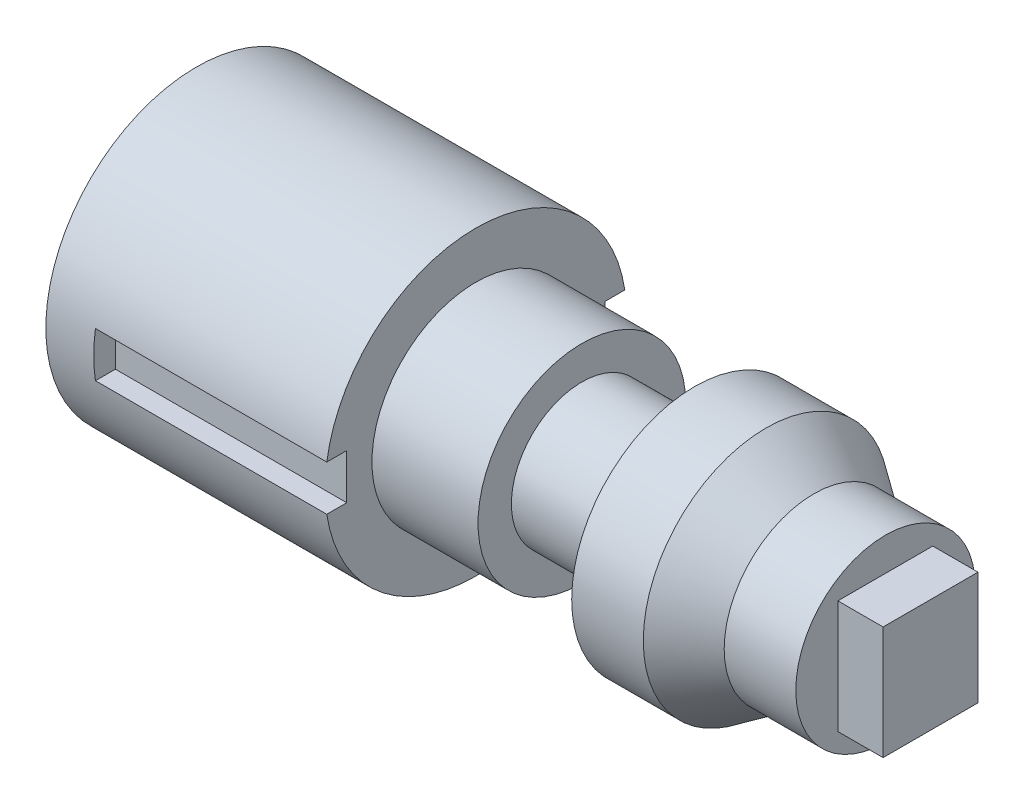
ISO-10303-21;
HEADER;
FILE_DESCRIPTION(('STEP AP214'),'2;1');
FILE_NAME('part.step','',(''),(''),'','','');
FILE_SCHEMA(('AUTOMOTIVE_DESIGN { 1 0 10303 214 1 1 1 1 }'));
ENDSEC;
DATA;
#1=APPLICATION_CONTEXT('core data for automotive mechanical design processes');
#2=APPLICATION_PROTOCOL_DEFINITION('international standard','automotive_design',2000,#1);
#3=PRODUCT_CONTEXT('',#1,'mechanical');
#4=PRODUCT('Part','Part','',(#3));
#5=PRODUCT_RELATED_PRODUCT_CATEGORY('part','',(#4));
#6=PRODUCT_DEFINITION_FORMATION('','',#4);
#7=PRODUCT_DEFINITION_CONTEXT('part definition',#1,'design');
#8=PRODUCT_DEFINITION('design','',#6,#7);
#9=PRODUCT_DEFINITION_SHAPE('','',#8);
#10=(LENGTH_UNIT() NAMED_UNIT(*) SI_UNIT(.MILLI.,.METRE.));
#11=(NAMED_UNIT(*) PLANE_ANGLE_UNIT() SI_UNIT($,.RADIAN.));
#12=(NAMED_UNIT(*) SI_UNIT($,.STERADIAN.) SOLID_ANGLE_UNIT());
#13=UNCERTAINTY_MEASURE_WITH_UNIT(LENGTH_MEASURE(1.E-05),#10,'distance_accuracy_value','');
#14=(GEOMETRIC_REPRESENTATION_CONTEXT(3) GLOBAL_UNCERTAINTY_ASSIGNED_CONTEXT((#13)) GLOBAL_UNIT_ASSIGNED_CONTEXT((#10,
#11,#12)) REPRESENTATION_CONTEXT('',''));
#15=CARTESIAN_POINT('',(0.,0.,0.));
#16=DIRECTION('',(0.,0.,1.));
#17=DIRECTION('',(1.,0.,0.));
#18=AXIS2_PLACEMENT_3D('',#15,#16,#17);
#19=CARTESIAN_POINT('',(45.7085192508289,0.,0.));
#20=DIRECTION('',(1.,0.,0.));
#21=DIRECTION('',(0.,0.,-1.));
#22=AXIS2_PLACEMENT_3D('',#19,#20,#21);
#23=CYLINDRICAL_SURFACE('',#22,10.);
#24=CARTESIAN_POINT('',(0.,0.,0.));
#25=DIRECTION('',(1.,0.,0.));
#26=DIRECTION('',(0.,0.,-1.));
#27=AXIS2_PLACEMENT_3D('',#24,#25,#26);
#28=CIRCLE('',#27,10.);
#29=CARTESIAN_POINT('',(0.,0.,-10.));
#30=VERTEX_POINT('',#29);
#31=EDGE_CURVE('E247',#30,#30,#28,.T.);
#32=ORIENTED_EDGE('',*,*,#31,.T.);
#33=EDGE_LOOP('',(#32));
#34=FACE_BOUND('',#33,.T.);
#35=CARTESIAN_POINT('',(3.17889936513499,0.,0.));
#36=DIRECTION('',(-1.,0.,0.));
#37=DIRECTION('',(0.,0.,1.));
#38=AXIS2_PLACEMENT_3D('',#35,#36,#37);
#39=CIRCLE('',#38,10.);
#40=CARTESIAN_POINT('',(3.17889936513498,-1.5,-9.88685996664259));
#41=VERTEX_POINT('',#40);
#42=CARTESIAN_POINT('',(3.17889936513498,1.5,-9.88685996664259));
#43=VERTEX_POINT('',#42);
#44=EDGE_CURVE('E11',#41,#43,#39,.F.);
#45=ORIENTED_EDGE('',*,*,#44,.F.);
#46=DIRECTION('',(1.,0.,0.));
#47=VECTOR('',#46,1.);
#48=CARTESIAN_POINT('',(45.7085192508289,-1.5,-9.88685996664259));
#49=LINE('',#48,#47);
#50=CARTESIAN_POINT('',(18.5256627897861,-1.5,-9.88685996664259));
#51=VERTEX_POINT('',#50);
#52=EDGE_CURVE('E206',#41,#51,#49,.T.);
#53=ORIENTED_EDGE('',*,*,#52,.T.);
#54=CARTESIAN_POINT('',(18.5256627897861,0.,0.));
#55=DIRECTION('',(1.,0.,0.));
#56=DIRECTION('',(0.,0.,-1.));
#57=AXIS2_PLACEMENT_3D('',#54,#55,#56);
#58=CIRCLE('',#57,10.);
#59=CARTESIAN_POINT('',(18.5256627897861,-1.5,9.88685996664259));
#60=VERTEX_POINT('',#59);
#61=EDGE_CURVE('E242',#60,#51,#58,.T.);
#62=ORIENTED_EDGE('',*,*,#61,.F.);
#63=DIRECTION('',(1.,0.,0.));
#64=VECTOR('',#63,1.);
#65=CARTESIAN_POINT('',(45.7085192508289,-1.5,9.88685996664259));
#66=LINE('',#65,#64);
#67=CARTESIAN_POINT('',(3.17889936513498,-1.5,9.88685996664259));
#68=VERTEX_POINT('',#67);
#69=EDGE_CURVE('E200',#68,#60,#66,.T.);
#70=ORIENTED_EDGE('',*,*,#69,.F.);
#71=CARTESIAN_POINT('',(3.17889936513499,0.,0.));
#72=DIRECTION('',(1.,0.,0.));
#73=DIRECTION('',(0.,0.,-1.));
#74=AXIS2_PLACEMENT_3D('',#71,#72,#73);
#75=CIRCLE('',#74,10.);
#76=CARTESIAN_POINT('',(3.17889936513498,1.5,9.88685996664259));
#77=VERTEX_POINT('',#76);
#78=EDGE_CURVE('E52',#68,#77,#75,.F.);
#79=ORIENTED_EDGE('',*,*,#78,.T.);
#80=DIRECTION('',(1.,0.,0.));
#81=VECTOR('',#80,1.);
#82=CARTESIAN_POINT('',(45.7085192508289,1.5,9.88685996664259));
#83=LINE('',#82,#81);
#84=CARTESIAN_POINT('',(18.5256627897861,1.5,9.88685996664259));
#85=VERTEX_POINT('',#84);
#86=EDGE_CURVE('E184',#77,#85,#83,.T.);
#87=ORIENTED_EDGE('',*,*,#86,.T.);
#88=CARTESIAN_POINT('',(18.5256627897861,1.5,-9.88685996664259));
#89=VERTEX_POINT('',#88);
#90=EDGE_CURVE('E243',#89,#85,#58,.T.);
#91=ORIENTED_EDGE('',*,*,#90,.F.);
#92=DIRECTION('',(1.,0.,0.));
#93=VECTOR('',#92,1.);
#94=CARTESIAN_POINT('',(45.7085192508289,1.5,-9.88685996664259));
#95=LINE('',#94,#93);
#96=EDGE_CURVE('E203',#43,#89,#95,.T.);
#97=ORIENTED_EDGE('',*,*,#96,.F.);
#98=EDGE_LOOP('',(#45,#53,#62,#70,#79,#87,#91,#97));
#99=FACE_BOUND('',#98,.T.);
#100=ADVANCED_FACE('F43',(#34,#99),#23,.T.);
#101=CARTESIAN_POINT('',(18.5256627897861,0.,-10.));
#102=DIRECTION('',(1.,0.,0.));
#103=DIRECTION('',(0.,0.,-1.));
#104=AXIS2_PLACEMENT_3D('',#101,#102,#103);
#105=PLANE('',#104);
#106=CARTESIAN_POINT('',(18.5256627897861,0.,0.));
#107=DIRECTION('',(1.,0.,0.));
#108=DIRECTION('',(0.,0.,-1.));
#109=AXIS2_PLACEMENT_3D('',#106,#107,#108);
#110=CIRCLE('',#109,6.89024048727054);
#111=CARTESIAN_POINT('',(18.5256627897861,0.,-6.89024048727054));
#112=VERTEX_POINT('',#111);
#113=EDGE_CURVE('E238',#112,#112,#110,.T.);
#114=ORIENTED_EDGE('',*,*,#113,.F.);
#115=EDGE_LOOP('',(#114));
#116=FACE_BOUND('',#115,.T.);
#117=ORIENTED_EDGE('',*,*,#61,.T.);
#118=DIRECTION('',(0.,0.,1.));
#119=VECTOR('',#118,1.);
#120=CARTESIAN_POINT('',(18.5256627897861,-1.5,-10.));
#121=LINE('',#120,#119);
#122=CARTESIAN_POINT('',(18.5256627897861,-1.5,-8.56238743965711));
#123=VERTEX_POINT('',#122);
#124=EDGE_CURVE('E268',#51,#123,#121,.T.);
#125=ORIENTED_EDGE('',*,*,#124,.T.);
#126=DIRECTION('',(0.,-1.,0.));
#127=VECTOR('',#126,1.);
#128=CARTESIAN_POINT('',(18.5256627897861,0.,-8.56238743965711));
#129=LINE('',#128,#127);
#130=CARTESIAN_POINT('',(18.5256627897861,1.5,-8.56238743965711));
#131=VERTEX_POINT('',#130);
#132=EDGE_CURVE('E265',#131,#123,#129,.T.);
#133=ORIENTED_EDGE('',*,*,#132,.F.);
#134=DIRECTION('',(0.,0.,1.));
#135=VECTOR('',#134,1.);
#136=CARTESIAN_POINT('',(18.5256627897861,1.5,-10.));
#137=LINE('',#136,#135);
#138=EDGE_CURVE('E262',#89,#131,#137,.T.);
#139=ORIENTED_EDGE('',*,*,#138,.F.);
#140=ORIENTED_EDGE('',*,*,#90,.T.);
#141=DIRECTION('',(0.,0.,-1.));
#142=VECTOR('',#141,1.);
#143=CARTESIAN_POINT('',(18.5256627897861,1.5,-10.));
#144=LINE('',#143,#142);
#145=CARTESIAN_POINT('',(18.5256627897861,1.5,8.56238743965711));
#146=VERTEX_POINT('',#145);
#147=EDGE_CURVE('E251',#85,#146,#144,.T.);
#148=ORIENTED_EDGE('',*,*,#147,.T.);
#149=DIRECTION('',(0.,-1.,0.));
#150=VECTOR('',#149,1.);
#151=CARTESIAN_POINT('',(18.5256627897861,0.,8.56238743965711));
#152=LINE('',#151,#150);
#153=CARTESIAN_POINT('',(18.5256627897861,-1.5,8.56238743965711));
#154=VERTEX_POINT('',#153);
#155=EDGE_CURVE('E255',#146,#154,#152,.T.);
#156=ORIENTED_EDGE('',*,*,#155,.T.);
#157=DIRECTION('',(0.,0.,-1.));
#158=VECTOR('',#157,1.);
#159=CARTESIAN_POINT('',(18.5256627897861,-1.5,-10.));
#160=LINE('',#159,#158);
#161=EDGE_CURVE('E259',#60,#154,#160,.T.);
#162=ORIENTED_EDGE('',*,*,#161,.F.);
#163=EDGE_LOOP('',(#117,#125,#133,#139,#140,#148,#156,#162));
#164=FACE_BOUND('',#163,.T.);
#165=ADVANCED_FACE('F295',(#116,#164),#105,.T.);
#166=CARTESIAN_POINT('',(0.,0.,0.));
#167=DIRECTION('',(-1.,0.,0.));
#168=DIRECTION('',(0.,0.,1.));
#169=AXIS2_PLACEMENT_3D('',#166,#167,#168);
#170=PLANE('',#169);
#171=ORIENTED_EDGE('',*,*,#31,.F.);
#172=EDGE_LOOP('',(#171));
#173=FACE_BOUND('',#172,.T.);
#174=ADVANCED_FACE('F45',(#173),#170,.T.);
#175=CARTESIAN_POINT('',(45.7085192508289,0.,0.));
#176=DIRECTION('',(1.,0.,0.));
#177=DIRECTION('',(0.,0.,-1.));
#178=AXIS2_PLACEMENT_3D('',#175,#176,#177);
#179=CYLINDRICAL_SURFACE('',#178,6.89024048727054);
#180=ORIENTED_EDGE('',*,*,#113,.T.);
#181=EDGE_LOOP('',(#180));
#182=FACE_BOUND('',#181,.T.);
#183=CARTESIAN_POINT('',(25.5632955305092,0.,0.));
#184=DIRECTION('',(1.,0.,0.));
#185=DIRECTION('',(0.,0.,-1.));
#186=AXIS2_PLACEMENT_3D('',#183,#184,#185);
#187=CIRCLE('',#186,6.89024048727054);
#188=CARTESIAN_POINT('',(25.5632955305092,0.,-6.89024048727054));
#189=VERTEX_POINT('',#188);
#190=EDGE_CURVE('E234',#189,#189,#187,.T.);
#191=ORIENTED_EDGE('',*,*,#190,.F.);
#192=EDGE_LOOP('',(#191));
#193=FACE_BOUND('',#192,.T.);
#194=ADVANCED_FACE('F331',(#182,#193),#179,.T.);
#195=CARTESIAN_POINT('',(25.5632955305092,0.,-6.89024048727054));
#196=DIRECTION('',(1.,0.,0.));
#197=DIRECTION('',(0.,0.,-1.));
#198=AXIS2_PLACEMENT_3D('',#195,#196,#197);
#199=PLANE('',#198);
#200=ORIENTED_EDGE('',*,*,#190,.T.);
#201=EDGE_LOOP('',(#200));
#202=FACE_BOUND('',#201,.T.);
#203=CARTESIAN_POINT('',(25.5632955305092,0.,0.));
#204=DIRECTION('',(1.,0.,0.));
#205=DIRECTION('',(0.,0.,-1.));
#206=AXIS2_PLACEMENT_3D('',#203,#204,#205);
#207=CIRCLE('',#206,4.67752868907863);
#208=CARTESIAN_POINT('',(25.5632955305092,0.,-4.67752868907863));
#209=VERTEX_POINT('',#208);
#210=EDGE_CURVE('E230',#209,#209,#207,.T.);
#211=ORIENTED_EDGE('',*,*,#210,.F.);
#212=EDGE_LOOP('',(#211));
#213=FACE_BOUND('',#212,.T.);
#214=ADVANCED_FACE('F334',(#202,#213),#199,.T.);
#215=CARTESIAN_POINT('',(45.7085192508289,0.,0.));
#216=DIRECTION('',(1.,0.,0.));
#217=DIRECTION('',(0.,0.,-1.));
#218=AXIS2_PLACEMENT_3D('',#215,#216,#217);
#219=CYLINDRICAL_SURFACE('',#218,4.67752868907863);
#220=ORIENTED_EDGE('',*,*,#210,.T.);
#221=EDGE_LOOP('',(#220));
#222=FACE_BOUND('',#221,.T.);
#223=CARTESIAN_POINT('',(33.0407803175274,0.,0.));
#224=DIRECTION('',(1.,0.,0.));
#225=DIRECTION('',(0.,0.,-1.));
#226=AXIS2_PLACEMENT_3D('',#223,#224,#225);
#227=CIRCLE('',#226,4.67752868907863);
#228=CARTESIAN_POINT('',(33.0407803175274,0.,-4.67752868907863));
#229=VERTEX_POINT('',#228);
#230=EDGE_CURVE('E226',#229,#229,#227,.T.);
#231=ORIENTED_EDGE('',*,*,#230,.F.);
#232=EDGE_LOOP('',(#231));
#233=FACE_BOUND('',#232,.T.);
#234=ADVANCED_FACE('F338',(#222,#233),#219,.T.);
#235=CARTESIAN_POINT('',(33.0407803175274,0.,-4.67752868907863));
#236=DIRECTION('',(-1.,0.,0.));
#237=DIRECTION('',(0.,0.,1.));
#238=AXIS2_PLACEMENT_3D('',#235,#236,#237);
#239=PLANE('',#238);
#240=ORIENTED_EDGE('',*,*,#230,.T.);
#241=EDGE_LOOP('',(#240));
#242=FACE_BOUND('',#241,.T.);
#243=CARTESIAN_POINT('',(33.0407803175274,0.,0.));
#244=DIRECTION('',(1.,0.,0.));
#245=DIRECTION('',(0.,0.,-1.));
#246=AXIS2_PLACEMENT_3D('',#243,#244,#245);
#247=CIRCLE('',#246,8.1526214055602);
#248=CARTESIAN_POINT('',(33.0407803175274,0.,-8.1526214055602));
#249=VERTEX_POINT('',#248);
#250=EDGE_CURVE('E222',#249,#249,#247,.T.);
#251=ORIENTED_EDGE('',*,*,#250,.F.);
#252=EDGE_LOOP('',(#251));
#253=FACE_BOUND('',#252,.T.);
#254=ADVANCED_FACE('F342',(#242,#253),#239,.T.);
#255=CARTESIAN_POINT('',(45.7085192508289,0.,0.));
#256=DIRECTION('',(1.,0.,0.));
#257=DIRECTION('',(0.,0.,-1.));
#258=AXIS2_PLACEMENT_3D('',#255,#256,#257);
#259=CYLINDRICAL_SURFACE('',#258,8.1526214055602);
#260=ORIENTED_EDGE('',*,*,#250,.T.);
#261=EDGE_LOOP('',(#260));
#262=FACE_BOUND('',#261,.T.);
#263=CARTESIAN_POINT('',(37.7911824175155,0.,0.));
#264=DIRECTION('',(1.,0.,0.));
#265=DIRECTION('',(0.,0.,-1.));
#266=AXIS2_PLACEMENT_3D('',#263,#264,#265);
#267=CIRCLE('',#266,8.1526214055602);
#268=CARTESIAN_POINT('',(37.7911824175155,0.,-8.1526214055602));
#269=VERTEX_POINT('',#268);
#270=EDGE_CURVE('E218',#269,#269,#267,.T.);
#271=ORIENTED_EDGE('',*,*,#270,.F.);
#272=EDGE_LOOP('',(#271));
#273=FACE_BOUND('',#272,.T.);
#274=ADVANCED_FACE('F346',(#262,#273),#259,.T.);
#275=CARTESIAN_POINT('',(40.9581171508409,0.,0.));
#276=DIRECTION('',(-1.,0.,0.));
#277=DIRECTION('',(0.,0.,1.));
#278=AXIS2_PLACEMENT_3D('',#275,#276,#277);
#279=CONICAL_SURFACE('',#278,5.95336117408424,0.606987664046407);
#280=ORIENTED_EDGE('',*,*,#270,.T.);
#281=EDGE_LOOP('',(#280));
#282=FACE_BOUND('',#281,.T.);
#283=CARTESIAN_POINT('',(40.9581171508409,0.,0.));
#284=DIRECTION('',(1.,0.,0.));
#285=DIRECTION('',(0.,0.,-1.));
#286=AXIS2_PLACEMENT_3D('',#283,#284,#285);
#287=CIRCLE('',#286,5.95336117408424);
#288=CARTESIAN_POINT('',(40.9581171508409,0.,-5.95336117408424));
#289=VERTEX_POINT('',#288);
#290=EDGE_CURVE('E214',#289,#289,#287,.T.);
#291=ORIENTED_EDGE('',*,*,#290,.F.);
#292=EDGE_LOOP('',(#291));
#293=FACE_BOUND('',#292,.T.);
#294=ADVANCED_FACE('F350',(#282,#293),#279,.T.);
#295=CARTESIAN_POINT('',(45.7085192508289,0.,0.));
#296=DIRECTION('',(1.,0.,0.));
#297=DIRECTION('',(0.,0.,-1.));
#298=AXIS2_PLACEMENT_3D('',#295,#296,#297);
#299=CYLINDRICAL_SURFACE('',#298,5.95336117408424);
#300=ORIENTED_EDGE('',*,*,#290,.T.);
#301=EDGE_LOOP('',(#300));
#302=FACE_BOUND('',#301,.T.);
#303=CARTESIAN_POINT('',(45.7085192508289,0.,0.));
#304=DIRECTION('',(1.,0.,0.));
#305=DIRECTION('',(0.,0.,-1.));
#306=AXIS2_PLACEMENT_3D('',#303,#304,#305);
#307=CIRCLE('',#306,5.95336117408424);
#308=CARTESIAN_POINT('',(45.7085192508289,0.,-5.95336117408424));
#309=VERTEX_POINT('',#308);
#310=EDGE_CURVE('E210',#309,#309,#307,.T.);
#311=ORIENTED_EDGE('',*,*,#310,.F.);
#312=EDGE_LOOP('',(#311));
#313=FACE_BOUND('',#312,.T.);
#314=ADVANCED_FACE('F354',(#302,#313),#299,.T.);
#315=CARTESIAN_POINT('',(45.7085192508289,0.,-5.95336117408424));
#316=DIRECTION('',(1.,0.,0.));
#317=DIRECTION('',(0.,0.,-1.));
#318=AXIS2_PLACEMENT_3D('',#315,#316,#317);
#319=PLANE('',#318);
#320=DIRECTION('',(0.,-1.,0.));
#321=VECTOR('',#320,1.);
#322=CARTESIAN_POINT('',(45.7085192508289,3.75333974069081,3.16058941680211));
#323=LINE('',#322,#321);
#324=CARTESIAN_POINT('',(45.7085192508289,3.75333974069081,3.16058941680211));
#325=VERTEX_POINT('',#324);
#326=CARTESIAN_POINT('',(45.7085192508289,-3.75574691954495,3.16058941680211));
#327=VERTEX_POINT('',#326);
#328=EDGE_CURVE('E59',#325,#327,#323,.T.);
#329=ORIENTED_EDGE('',*,*,#328,.F.);
#330=DIRECTION('',(0.,0.,1.));
#331=VECTOR('',#330,1.);
#332=CARTESIAN_POINT('',(45.7085192508289,3.75333974069081,3.16058941680211));
#333=LINE('',#332,#331);
#334=CARTESIAN_POINT('',(45.7085192508289,3.75333974069081,-3.13626800680367));
#335=VERTEX_POINT('',#334);
#336=EDGE_CURVE('E63',#335,#325,#333,.T.);
#337=ORIENTED_EDGE('',*,*,#336,.F.);
#338=DIRECTION('',(0.,1.,0.));
#339=VECTOR('',#338,1.);
#340=CARTESIAN_POINT('',(45.7085192508289,3.75333974069081,-3.13626800680367));
#341=LINE('',#340,#339);
#342=CARTESIAN_POINT('',(45.7085192508289,-3.75574691954495,-3.13626800680367));
#343=VERTEX_POINT('',#342);
#344=EDGE_CURVE('E578',#343,#335,#341,.T.);
#345=ORIENTED_EDGE('',*,*,#344,.F.);
#346=DIRECTION('',(0.,0.,-1.));
#347=VECTOR('',#346,1.);
#348=CARTESIAN_POINT('',(45.7085192508289,-3.75574691954495,3.16058941680211));
#349=LINE('',#348,#347);
#350=EDGE_CURVE('E588',#327,#343,#349,.T.);
#351=ORIENTED_EDGE('',*,*,#350,.F.);
#352=EDGE_LOOP('',(#329,#337,#345,#351));
#353=FACE_BOUND('',#352,.T.);
#354=ORIENTED_EDGE('',*,*,#310,.T.);
#355=EDGE_LOOP('',(#354));
#356=FACE_BOUND('',#355,.T.);
#357=ADVANCED_FACE('F358',(#353,#356),#319,.T.);
#358=CARTESIAN_POINT('',(3.17889936513498,-1.5,10.7378474406123));
#359=DIRECTION('',(1.,0.,0.));
#360=DIRECTION('',(0.,0.,-1.));
#361=AXIS2_PLACEMENT_3D('',#358,#359,#360);
#362=PLANE('',#361);
#363=DIRECTION('',(0.,0.,-1.));
#364=VECTOR('',#363,1.);
#365=CARTESIAN_POINT('',(3.17889936513498,-1.5,10.7378474406123));
#366=LINE('',#365,#364);
#367=CARTESIAN_POINT('',(3.17889936513498,-1.5,8.56238743965711));
#368=VERTEX_POINT('',#367);
#369=EDGE_CURVE('E189',#68,#368,#366,.T.);
#370=ORIENTED_EDGE('',*,*,#369,.T.);
#371=DIRECTION('',(0.,1.,0.));
#372=VECTOR('',#371,1.);
#373=CARTESIAN_POINT('',(3.17889936513498,-1.5,8.56238743965711));
#374=LINE('',#373,#372);
#375=CARTESIAN_POINT('',(3.17889936513498,1.5,8.56238743965711));
#376=VERTEX_POINT('',#375);
#377=EDGE_CURVE('E155',#368,#376,#374,.T.);
#378=ORIENTED_EDGE('',*,*,#377,.T.);
#379=DIRECTION('',(0.,0.,-1.));
#380=VECTOR('',#379,1.);
#381=CARTESIAN_POINT('',(3.17889936513498,1.5,10.7378474406123));
#382=LINE('',#381,#380);
#383=EDGE_CURVE('E178',#77,#376,#382,.T.);
#384=ORIENTED_EDGE('',*,*,#383,.F.);
#385=ORIENTED_EDGE('',*,*,#78,.F.);
#386=EDGE_LOOP('',(#370,#378,#384,#385));
#387=FACE_BOUND('',#386,.T.);
#388=ADVANCED_FACE('F281',(#387),#362,.T.);
#389=CARTESIAN_POINT('',(3.17889936513498,-1.5,8.56238743965711));
#390=DIRECTION('',(0.,0.,1.));
#391=DIRECTION('',(1.,0.,0.));
#392=AXIS2_PLACEMENT_3D('',#389,#390,#391);
#393=PLANE('',#392);
#394=DIRECTION('',(1.,0.,0.));
#395=VECTOR('',#394,1.);
#396=CARTESIAN_POINT('',(3.17889936513498,1.5,8.56238743965711));
#397=LINE('',#396,#395);
#398=EDGE_CURVE('E186',#376,#146,#397,.T.);
#399=ORIENTED_EDGE('',*,*,#398,.F.);
#400=ORIENTED_EDGE('',*,*,#377,.F.);
#401=DIRECTION('',(1.,0.,0.));
#402=VECTOR('',#401,1.);
#403=CARTESIAN_POINT('',(3.17889936513498,-1.5,8.56238743965711));
#404=LINE('',#403,#402);
#405=EDGE_CURVE('E160',#368,#154,#404,.T.);
#406=ORIENTED_EDGE('',*,*,#405,.T.);
#407=ORIENTED_EDGE('',*,*,#155,.F.);
#408=EDGE_LOOP('',(#399,#400,#406,#407));
#409=FACE_BOUND('',#408,.T.);
#410=ADVANCED_FACE('F290',(#409),#393,.T.);
#411=CARTESIAN_POINT('',(0.,-1.5,0.));
#412=DIRECTION('',(0.,-1.,0.));
#413=DIRECTION('',(0.,0.,-1.));
#414=AXIS2_PLACEMENT_3D('',#411,#412,#413);
#415=PLANE('',#414);
#416=ORIENTED_EDGE('',*,*,#69,.T.);
#417=ORIENTED_EDGE('',*,*,#161,.T.);
#418=ORIENTED_EDGE('',*,*,#405,.F.);
#419=ORIENTED_EDGE('',*,*,#369,.F.);
#420=EDGE_LOOP('',(#416,#417,#418,#419));
#421=FACE_BOUND('',#420,.T.);
#422=ADVANCED_FACE('F284',(#421),#415,.F.);
#423=CARTESIAN_POINT('',(0.,1.5,0.));
#424=DIRECTION('',(0.,-1.,0.));
#425=DIRECTION('',(0.,0.,-1.));
#426=AXIS2_PLACEMENT_3D('',#423,#424,#425);
#427=PLANE('',#426);
#428=ORIENTED_EDGE('',*,*,#383,.T.);
#429=ORIENTED_EDGE('',*,*,#398,.T.);
#430=ORIENTED_EDGE('',*,*,#147,.F.);
#431=ORIENTED_EDGE('',*,*,#86,.F.);
#432=EDGE_LOOP('',(#428,#429,#430,#431));
#433=FACE_BOUND('',#432,.T.);
#434=ADVANCED_FACE('F292',(#433),#427,.T.);
#435=CARTESIAN_POINT('',(3.17889936513498,-1.5,-10.7378474406123));
#436=DIRECTION('',(-1.,0.,0.));
#437=DIRECTION('',(0.,0.,1.));
#438=AXIS2_PLACEMENT_3D('',#435,#436,#437);
#439=PLANE('',#438);
#440=ORIENTED_EDGE('',*,*,#44,.T.);
#441=DIRECTION('',(0.,0.,1.));
#442=VECTOR('',#441,1.);
#443=CARTESIAN_POINT('',(3.17889936513498,1.5,-10.7378474406123));
#444=LINE('',#443,#442);
#445=CARTESIAN_POINT('',(3.17889936513498,1.5,-8.56238743965711));
#446=VERTEX_POINT('',#445);
#447=EDGE_CURVE('E175',#43,#446,#444,.T.);
#448=ORIENTED_EDGE('',*,*,#447,.T.);
#449=DIRECTION('',(0.,1.,0.));
#450=VECTOR('',#449,1.);
#451=CARTESIAN_POINT('',(3.17889936513498,-1.5,-8.56238743965711));
#452=LINE('',#451,#450);
#453=CARTESIAN_POINT('',(3.17889936513498,-1.5,-8.56238743965711));
#454=VERTEX_POINT('',#453);
#455=EDGE_CURVE('E174',#454,#446,#452,.T.);
#456=ORIENTED_EDGE('',*,*,#455,.F.);
#457=DIRECTION('',(0.,0.,1.));
#458=VECTOR('',#457,1.);
#459=CARTESIAN_POINT('',(3.17889936513498,-1.5,-10.7378474406123));
#460=LINE('',#459,#458);
#461=EDGE_CURVE('E166',#41,#454,#460,.T.);
#462=ORIENTED_EDGE('',*,*,#461,.F.);
#463=EDGE_LOOP('',(#440,#448,#456,#462));
#464=FACE_BOUND('',#463,.T.);
#465=ADVANCED_FACE('F305',(#464),#439,.F.);
#466=CARTESIAN_POINT('',(3.17889936513498,-1.5,-8.56238743965711));
#467=DIRECTION('',(0.,0.,1.));
#468=DIRECTION('',(1.,0.,0.));
#469=AXIS2_PLACEMENT_3D('',#466,#467,#468);
#470=PLANE('',#469);
#471=ORIENTED_EDGE('',*,*,#132,.T.);
#472=DIRECTION('',(1.,0.,0.));
#473=VECTOR('',#472,1.);
#474=CARTESIAN_POINT('',(3.17889936513498,-1.5,-8.56238743965711));
#475=LINE('',#474,#473);
#476=EDGE_CURVE('E169',#454,#123,#475,.T.);
#477=ORIENTED_EDGE('',*,*,#476,.F.);
#478=ORIENTED_EDGE('',*,*,#455,.T.);
#479=DIRECTION('',(1.,0.,0.));
#480=VECTOR('',#479,1.);
#481=CARTESIAN_POINT('',(3.17889936513498,1.5,-8.56238743965711));
#482=LINE('',#481,#480);
#483=EDGE_CURVE('E170',#446,#131,#482,.T.);
#484=ORIENTED_EDGE('',*,*,#483,.T.);
#485=EDGE_LOOP('',(#471,#477,#478,#484));
#486=FACE_BOUND('',#485,.T.);
#487=ADVANCED_FACE('F309',(#486),#470,.F.);
#488=CARTESIAN_POINT('',(0.,-1.5,0.));
#489=DIRECTION('',(0.,1.,0.));
#490=DIRECTION('',(0.,0.,1.));
#491=AXIS2_PLACEMENT_3D('',#488,#489,#490);
#492=PLANE('',#491);
#493=ORIENTED_EDGE('',*,*,#461,.T.);
#494=ORIENTED_EDGE('',*,*,#476,.T.);
#495=ORIENTED_EDGE('',*,*,#124,.F.);
#496=ORIENTED_EDGE('',*,*,#52,.F.);
#497=EDGE_LOOP('',(#493,#494,#495,#496));
#498=FACE_BOUND('',#497,.T.);
#499=ADVANCED_FACE('F311',(#498),#492,.T.);
#500=CARTESIAN_POINT('',(0.,1.5,0.));
#501=DIRECTION('',(0.,1.,0.));
#502=DIRECTION('',(0.,0.,1.));
#503=AXIS2_PLACEMENT_3D('',#500,#501,#502);
#504=PLANE('',#503);
#505=ORIENTED_EDGE('',*,*,#96,.T.);
#506=ORIENTED_EDGE('',*,*,#138,.T.);
#507=ORIENTED_EDGE('',*,*,#483,.F.);
#508=ORIENTED_EDGE('',*,*,#447,.F.);
#509=EDGE_LOOP('',(#505,#506,#507,#508));
#510=FACE_BOUND('',#509,.T.);
#511=ADVANCED_FACE('F301',(#510),#504,.F.);
#512=CARTESIAN_POINT('',(48.7085192508289,3.75333974069081,3.16058941680211));
#513=DIRECTION('',(0.,0.,-1.));
#514=DIRECTION('',(-1.,0.,0.));
#515=AXIS2_PLACEMENT_3D('',#512,#513,#514);
#516=PLANE('',#515);
#517=ORIENTED_EDGE('',*,*,#328,.T.);
#518=DIRECTION('',(-1.,0.,0.));
#519=VECTOR('',#518,1.);
#520=CARTESIAN_POINT('',(48.7085192508289,-3.75574691954495,3.16058941680211));
#521=LINE('',#520,#519);
#522=CARTESIAN_POINT('',(48.7085192508289,-3.75574691954495,3.16058941680211));
#523=VERTEX_POINT('',#522);
#524=EDGE_CURVE('E135',#523,#327,#521,.T.);
#525=ORIENTED_EDGE('',*,*,#524,.F.);
#526=DIRECTION('',(0.,-1.,0.));
#527=VECTOR('',#526,1.);
#528=CARTESIAN_POINT('',(48.7085192508289,3.75333974069081,3.16058941680211));
#529=LINE('',#528,#527);
#530=CARTESIAN_POINT('',(48.7085192508289,3.75333974069081,3.16058941680211));
#531=VERTEX_POINT('',#530);
#532=EDGE_CURVE('E142',#531,#523,#529,.T.);
#533=ORIENTED_EDGE('',*,*,#532,.F.);
#534=DIRECTION('',(-1.,0.,0.));
#535=VECTOR('',#534,1.);
#536=CARTESIAN_POINT('',(48.7085192508289,3.75333974069081,3.16058941680211));
#537=LINE('',#536,#535);
#538=EDGE_CURVE('E575',#531,#325,#537,.T.);
#539=ORIENTED_EDGE('',*,*,#538,.T.);
#540=EDGE_LOOP('',(#517,#525,#533,#539));
#541=FACE_BOUND('',#540,.T.);
#542=ADVANCED_FACE('F153',(#541),#516,.F.);
#543=CARTESIAN_POINT('',(48.7085192508289,-3.75574691954495,3.16058941680211));
#544=DIRECTION('',(0.,1.,0.));
#545=DIRECTION('',(0.,0.,1.));
#546=AXIS2_PLACEMENT_3D('',#543,#544,#545);
#547=PLANE('',#546);
#548=ORIENTED_EDGE('',*,*,#350,.T.);
#549=DIRECTION('',(-1.,0.,0.));
#550=VECTOR('',#549,1.);
#551=CARTESIAN_POINT('',(48.7085192508289,-3.75574691954495,-3.13626800680367));
#552=LINE('',#551,#550);
#553=CARTESIAN_POINT('',(48.7085192508289,-3.75574691954495,-3.13626800680367));
#554=VERTEX_POINT('',#553);
#555=EDGE_CURVE('E137',#554,#343,#552,.T.);
#556=ORIENTED_EDGE('',*,*,#555,.F.);
#557=DIRECTION('',(0.,0.,-1.));
#558=VECTOR('',#557,1.);
#559=CARTESIAN_POINT('',(48.7085192508289,-3.75574691954495,3.16058941680211));
#560=LINE('',#559,#558);
#561=EDGE_CURVE('E130',#523,#554,#560,.T.);
#562=ORIENTED_EDGE('',*,*,#561,.F.);
#563=ORIENTED_EDGE('',*,*,#524,.T.);
#564=EDGE_LOOP('',(#548,#556,#562,#563));
#565=FACE_BOUND('',#564,.T.);
#566=ADVANCED_FACE('F133',(#565),#547,.F.);
#567=CARTESIAN_POINT('',(48.7085192508289,3.75333974069081,-3.13626800680367));
#568=DIRECTION('',(0.,0.,1.));
#569=DIRECTION('',(1.,0.,0.));
#570=AXIS2_PLACEMENT_3D('',#567,#568,#569);
#571=PLANE('',#570);
#572=ORIENTED_EDGE('',*,*,#344,.T.);
#573=DIRECTION('',(-1.,0.,0.));
#574=VECTOR('',#573,1.);
#575=CARTESIAN_POINT('',(48.7085192508289,3.75333974069081,-3.13626800680367));
#576=LINE('',#575,#574);
#577=CARTESIAN_POINT('',(48.7085192508289,3.75333974069081,-3.13626800680367));
#578=VERTEX_POINT('',#577);
#579=EDGE_CURVE('E162',#578,#335,#576,.T.);
#580=ORIENTED_EDGE('',*,*,#579,.F.);
#581=DIRECTION('',(0.,1.,0.));
#582=VECTOR('',#581,1.);
#583=CARTESIAN_POINT('',(48.7085192508289,3.75333974069081,-3.13626800680367));
#584=LINE('',#583,#582);
#585=EDGE_CURVE('E141',#554,#578,#584,.T.);
#586=ORIENTED_EDGE('',*,*,#585,.F.);
#587=ORIENTED_EDGE('',*,*,#555,.T.);
#588=EDGE_LOOP('',(#572,#580,#586,#587));
#589=FACE_BOUND('',#588,.T.);
#590=ADVANCED_FACE('F414',(#589),#571,.F.);
#591=CARTESIAN_POINT('',(48.7085192508289,3.75333974069081,3.16058941680211));
#592=DIRECTION('',(0.,-1.,0.));
#593=DIRECTION('',(0.,0.,-1.));
#594=AXIS2_PLACEMENT_3D('',#591,#592,#593);
#595=PLANE('',#594);
#596=ORIENTED_EDGE('',*,*,#336,.T.);
#597=ORIENTED_EDGE('',*,*,#538,.F.);
#598=DIRECTION('',(0.,0.,1.));
#599=VECTOR('',#598,1.);
#600=CARTESIAN_POINT('',(48.7085192508289,3.75333974069081,3.16058941680211));
#601=LINE('',#600,#599);
#602=EDGE_CURVE('E147',#578,#531,#601,.T.);
#603=ORIENTED_EDGE('',*,*,#602,.F.);
#604=ORIENTED_EDGE('',*,*,#579,.T.);
#605=EDGE_LOOP('',(#596,#597,#603,#604));
#606=FACE_BOUND('',#605,.T.);
#607=ADVANCED_FACE('F424',(#606),#595,.F.);
#608=CARTESIAN_POINT('',(48.7085192508289,0.,0.));
#609=DIRECTION('',(1.,0.,0.));
#610=DIRECTION('',(0.,0.,-1.));
#611=AXIS2_PLACEMENT_3D('',#608,#609,#610);
#612=PLANE('',#611);
#613=ORIENTED_EDGE('',*,*,#532,.T.);
#614=ORIENTED_EDGE('',*,*,#561,.T.);
#615=ORIENTED_EDGE('',*,*,#585,.T.);
#616=ORIENTED_EDGE('',*,*,#602,.T.);
#617=EDGE_LOOP('',(#613,#614,#615,#616));
#618=FACE_BOUND('',#617,.T.);
#619=ADVANCED_FACE('F145',(#618),#612,.T.);
#620=CLOSED_SHELL('',(#100,#165,#174,#194,#214,#234,#254,#274,#294,#314,#357,#388,#410,#422,
#434,#465,#487,#499,#511,#542,#566,#590,#607,#619));
#621=MANIFOLD_SOLID_BREP('B2',#620);
#622=ADVANCED_BREP_SHAPE_REPRESENTATION('',(#18,#621),#14);
#623=SHAPE_DEFINITION_REPRESENTATION(#9,#622);
ENDSEC;
END-ISO-10303-21;
